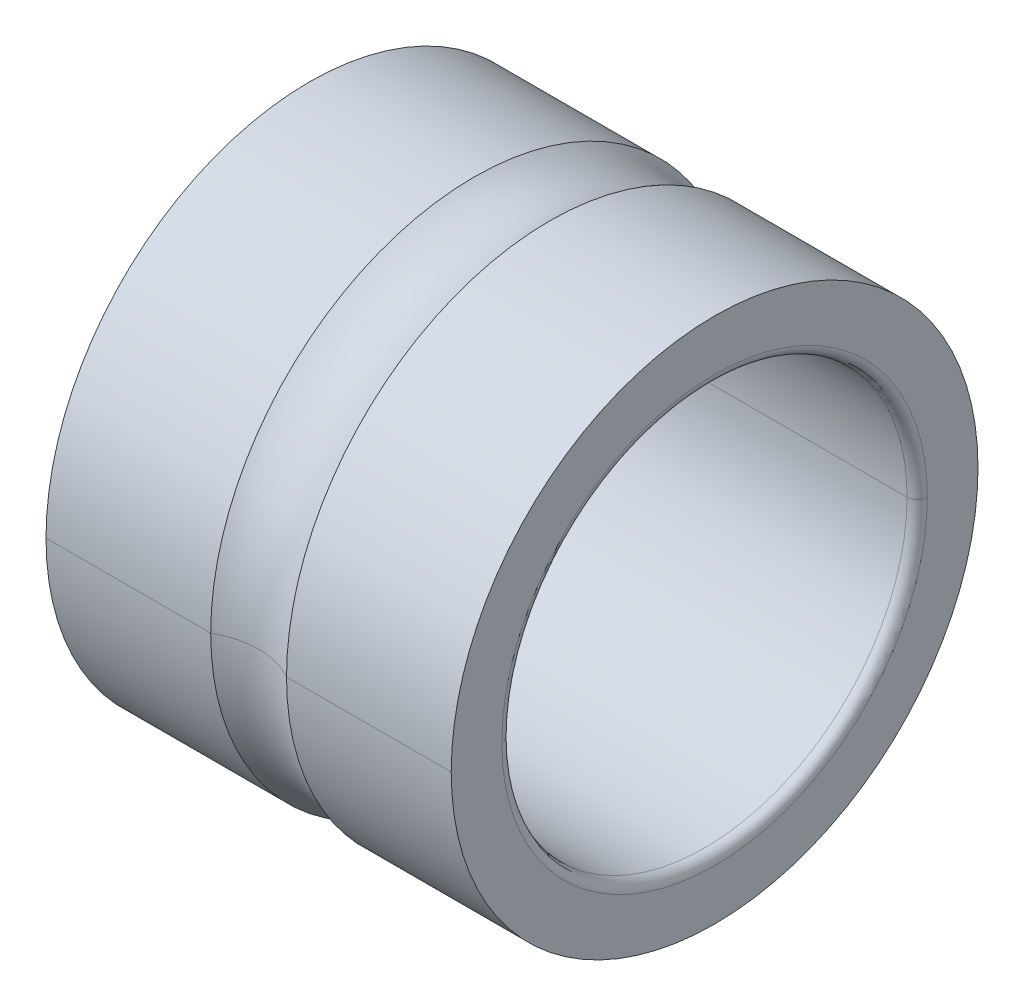
ISO-10303-21;
HEADER;
FILE_DESCRIPTION(('STEP AP214'),'2;1');
FILE_NAME('part.step','',(''),(''),'','','');
FILE_SCHEMA(('AUTOMOTIVE_DESIGN { 1 0 10303 214 1 1 1 1 }'));
ENDSEC;
DATA;
#1=APPLICATION_CONTEXT('core data for automotive mechanical design processes');
#2=APPLICATION_PROTOCOL_DEFINITION('international standard','automotive_design',2000,#1);
#3=PRODUCT_CONTEXT('',#1,'mechanical');
#4=PRODUCT('Part','Part','',(#3));
#5=PRODUCT_RELATED_PRODUCT_CATEGORY('part','',(#4));
#6=PRODUCT_DEFINITION_FORMATION('','',#4);
#7=PRODUCT_DEFINITION_CONTEXT('part definition',#1,'design');
#8=PRODUCT_DEFINITION('design','',#6,#7);
#9=PRODUCT_DEFINITION_SHAPE('','',#8);
#10=(LENGTH_UNIT() NAMED_UNIT(*) SI_UNIT(.MILLI.,.METRE.));
#11=(NAMED_UNIT(*) PLANE_ANGLE_UNIT() SI_UNIT($,.RADIAN.));
#12=(NAMED_UNIT(*) SI_UNIT($,.STERADIAN.) SOLID_ANGLE_UNIT());
#13=UNCERTAINTY_MEASURE_WITH_UNIT(LENGTH_MEASURE(1.E-05),#10,'distance_accuracy_value','');
#14=(GEOMETRIC_REPRESENTATION_CONTEXT(3) GLOBAL_UNCERTAINTY_ASSIGNED_CONTEXT((#13)) GLOBAL_UNIT_ASSIGNED_CONTEXT((#10,
#11,#12)) REPRESENTATION_CONTEXT('',''));
#15=CARTESIAN_POINT('',(0.,0.,0.));
#16=DIRECTION('',(0.,0.,1.));
#17=DIRECTION('',(1.,0.,0.));
#18=AXIS2_PLACEMENT_3D('',#15,#16,#17);
#19=CARTESIAN_POINT('',(0.,2.6,0.));
#20=DIRECTION('',(-1.,0.,0.));
#21=DIRECTION('',(0.,0.,1.));
#22=AXIS2_PLACEMENT_3D('',#19,#20,#21);
#23=PLANE('',#22);
#24=CARTESIAN_POINT('',(0.,0.,0.));
#25=DIRECTION('',(1.,0.,0.));
#26=DIRECTION('',(0.,0.,-1.));
#27=AXIS2_PLACEMENT_3D('',#24,#25,#26);
#28=CIRCLE('',#27,2.1);
#29=CARTESIAN_POINT('',(0.,0.,-2.1));
#30=VERTEX_POINT('',#29);
#31=CARTESIAN_POINT('',(0.,0.,2.1));
#32=VERTEX_POINT('',#31);
#33=EDGE_CURVE('E11',#30,#32,#28,.T.);
#34=ORIENTED_EDGE('',*,*,#33,.T.);
#35=CARTESIAN_POINT('',(0.,0.,0.));
#36=DIRECTION('',(1.,0.,0.));
#37=DIRECTION('',(0.,0.,-1.));
#38=AXIS2_PLACEMENT_3D('',#35,#36,#37);
#39=CIRCLE('',#38,2.1);
#40=EDGE_CURVE('E25',#32,#30,#39,.T.);
#41=ORIENTED_EDGE('',*,*,#40,.T.);
#42=EDGE_LOOP('',(#34,#41));
#43=FACE_BOUND('',#42,.T.);
#44=CARTESIAN_POINT('',(0.,0.,0.));
#45=DIRECTION('',(1.,0.,0.));
#46=DIRECTION('',(0.,0.,-1.));
#47=AXIS2_PLACEMENT_3D('',#44,#45,#46);
#48=CIRCLE('',#47,2.6);
#49=CARTESIAN_POINT('',(0.,0.,-2.6));
#50=VERTEX_POINT('',#49);
#51=CARTESIAN_POINT('',(0.,0.,2.6));
#52=VERTEX_POINT('',#51);
#53=EDGE_CURVE('E323',#50,#52,#48,.T.);
#54=ORIENTED_EDGE('',*,*,#53,.F.);
#55=CARTESIAN_POINT('',(0.,0.,0.));
#56=DIRECTION('',(1.,0.,0.));
#57=DIRECTION('',(0.,0.,-1.));
#58=AXIS2_PLACEMENT_3D('',#55,#56,#57);
#59=CIRCLE('',#58,2.6);
#60=EDGE_CURVE('E318',#52,#50,#59,.T.);
#61=ORIENTED_EDGE('',*,*,#60,.F.);
#62=EDGE_LOOP('',(#54,#61));
#63=FACE_BOUND('',#62,.T.);
#64=ADVANCED_FACE('F17',(#43,#63),#23,.T.);
#65=CARTESIAN_POINT('',(4.,0.,0.));
#66=DIRECTION('',(-1.,0.,0.));
#67=DIRECTION('',(0.,1.,0.));
#68=AXIS2_PLACEMENT_3D('',#65,#66,#67);
#69=CYLINDRICAL_SURFACE('',#68,2.6);
#70=ORIENTED_EDGE('',*,*,#60,.T.);
#71=DIRECTION('',(-1.,0.,0.));
#72=VECTOR('',#71,1.);
#73=CARTESIAN_POINT('',(1.6258342613226,0.,-2.6));
#74=LINE('',#73,#72);
#75=CARTESIAN_POINT('',(1.6258342613226,0.,-2.6));
#76=VERTEX_POINT('',#75);
#77=EDGE_CURVE('E313',#76,#50,#74,.T.);
#78=ORIENTED_EDGE('',*,*,#77,.F.);
#79=CARTESIAN_POINT('',(1.6258342613226,0.,0.));
#80=DIRECTION('',(1.,0.,0.));
#81=DIRECTION('',(0.,0.,-1.));
#82=AXIS2_PLACEMENT_3D('',#79,#80,#81);
#83=CIRCLE('',#82,2.6);
#84=CARTESIAN_POINT('',(1.6258342613226,0.,2.6));
#85=VERTEX_POINT('',#84);
#86=EDGE_CURVE('E309',#85,#76,#83,.T.);
#87=ORIENTED_EDGE('',*,*,#86,.F.);
#88=DIRECTION('',(-1.,0.,0.));
#89=VECTOR('',#88,1.);
#90=CARTESIAN_POINT('',(1.6258342613226,0.,2.6));
#91=LINE('',#90,#89);
#92=EDGE_CURVE('E304',#85,#52,#91,.T.);
#93=ORIENTED_EDGE('',*,*,#92,.T.);
#94=EDGE_LOOP('',(#70,#78,#87,#93));
#95=FACE_BOUND('',#94,.T.);
#96=ADVANCED_FACE('F338',(#95),#69,.T.);
#97=CARTESIAN_POINT('',(4.,0.,0.));
#98=DIRECTION('',(-1.,0.,0.));
#99=DIRECTION('',(0.,-1.,0.));
#100=AXIS2_PLACEMENT_3D('',#97,#98,#99);
#101=CYLINDRICAL_SURFACE('',#100,2.6);
#102=CARTESIAN_POINT('',(1.6258342613226,0.,0.));
#103=DIRECTION('',(1.,0.,0.));
#104=DIRECTION('',(0.,0.,-1.));
#105=AXIS2_PLACEMENT_3D('',#102,#103,#104);
#106=CIRCLE('',#105,2.6);
#107=EDGE_CURVE('E302',#76,#85,#106,.T.);
#108=ORIENTED_EDGE('',*,*,#107,.F.);
#109=ORIENTED_EDGE('',*,*,#77,.T.);
#110=ORIENTED_EDGE('',*,*,#53,.T.);
#111=ORIENTED_EDGE('',*,*,#92,.F.);
#112=EDGE_LOOP('',(#108,#109,#110,#111));
#113=FACE_BOUND('',#112,.T.);
#114=ADVANCED_FACE('F335',(#113),#101,.T.);
#115=CARTESIAN_POINT('',(2.,0.,0.));
#116=DIRECTION('',(1.,0.,0.));
#117=DIRECTION('',(0.,-1.,0.));
#118=AXIS2_PLACEMENT_3D('',#115,#116,#117);
#119=TOROIDAL_SURFACE('',#118,3.25,0.75);
#120=ORIENTED_EDGE('',*,*,#107,.T.);
#121=CARTESIAN_POINT('',(2.3741657386774,0.,2.6));
#122=CARTESIAN_POINT('',(2.36709274948748,0.,2.59592844855521));
#123=CARTESIAN_POINT('',(2.35995325635981,0.,2.5919724333997));
#124=CARTESIAN_POINT('',(2.34554897522928,0.,2.58429549354971));
#125=CARTESIAN_POINT('',(2.33828418722642,0.,2.58057456885522));
#126=CARTESIAN_POINT('',(2.32363702934586,0.,2.57337182780966));
#127=CARTESIAN_POINT('',(2.31625465946816,0.,2.5698900114586));
#128=CARTESIAN_POINT('',(2.30138021190552,0.,2.56316918306985));
#129=CARTESIAN_POINT('',(2.29388813422059,0.,2.55993017103215));
#130=CARTESIAN_POINT('',(2.27880225242789,0.,2.55369840649824));
#131=CARTESIAN_POINT('',(2.27120844832012,0.,2.55070565400202));
#132=CARTESIAN_POINT('',(2.25592720603228,0.,2.5449695965506));
#133=CARTESIAN_POINT('',(2.24823976785221,0.,2.54222629159541));
#134=CARTESIAN_POINT('',(2.2327794488567,0.,2.53699205271054));
#135=CARTESIAN_POINT('',(2.22500656804126,0.,2.53450111878086));
#136=CARTESIAN_POINT('',(2.20938364644233,0.,2.52977427616394));
#137=CARTESIAN_POINT('',(2.20153360565885,0.,2.52753836747669));
#138=CARTESIAN_POINT('',(2.1857647289619,0.,2.52332395790437));
#139=CARTESIAN_POINT('',(2.17784589304843,0.,2.52134545701929));
#140=CARTESIAN_POINT('',(2.16194786424952,0.,2.51764797129756));
#141=CARTESIAN_POINT('',(2.15396867136409,0.,2.5159289864609));
#142=CARTESIAN_POINT('',(2.13795843109094,0.,2.51275236455371));
#143=CARTESIAN_POINT('',(2.12992738370323,0.,2.51129472748317));
#144=CARTESIAN_POINT('',(2.11382199215127,0.,2.50864235433715));
#145=CARTESIAN_POINT('',(2.10574764798703,0.,2.50744761826166));
#146=CARTESIAN_POINT('',(2.08956426674372,0.,2.50532232019299));
#147=CARTESIAN_POINT('',(2.08145522966466,0.,2.50439175819981));
#148=CARTESIAN_POINT('',(2.06521110342155,0.,2.50279579988424));
#149=CARTESIAN_POINT('',(2.05707601425751,0.,2.50213040356185));
#150=CARTESIAN_POINT('',(2.04078845243487,0.,2.50106548562104));
#151=CARTESIAN_POINT('',(2.03263597977627,0.,2.50066596400261));
#152=CARTESIAN_POINT('',(2.01632233807845,0.,2.5001332211921));
#153=CARTESIAN_POINT('',(2.00816116903922,0.,2.5));
#154=CARTESIAN_POINT('',(1.99183883096078,0.,2.5));
#155=CARTESIAN_POINT('',(1.98367766192156,0.,2.5001332211921));
#156=CARTESIAN_POINT('',(1.96736402022374,0.,2.50066596400262));
#157=CARTESIAN_POINT('',(1.95921154756514,0.,2.50106548562104));
#158=CARTESIAN_POINT('',(1.9429239857425,0.,2.50213040356185));
#159=CARTESIAN_POINT('',(1.93478889657845,0.,2.50279579988424));
#160=CARTESIAN_POINT('',(1.91854477033534,0.,2.50439175819981));
#161=CARTESIAN_POINT('',(1.91043573325628,0.,2.50532232019299));
#162=CARTESIAN_POINT('',(1.89425235201297,0.,2.50744761826166));
#163=CARTESIAN_POINT('',(1.88617800784873,0.,2.50864235433715));
#164=CARTESIAN_POINT('',(1.87007261629678,0.,2.51129472748317));
#165=CARTESIAN_POINT('',(1.86204156890906,0.,2.51275236455371));
#166=CARTESIAN_POINT('',(1.84603132863591,0.,2.5159289864609));
#167=CARTESIAN_POINT('',(1.83805213575048,0.,2.51764797129756));
#168=CARTESIAN_POINT('',(1.82215410695158,0.,2.52134545701929));
#169=CARTESIAN_POINT('',(1.8142352710381,0.,2.52332395790437));
#170=CARTESIAN_POINT('',(1.79846639434115,0.,2.52753836747669));
#171=CARTESIAN_POINT('',(1.79061635355767,0.,2.52977427616394));
#172=CARTESIAN_POINT('',(1.77499343195874,0.,2.53450111878086));
#173=CARTESIAN_POINT('',(1.7672205511433,0.,2.53699205271054));
#174=CARTESIAN_POINT('',(1.75176023214779,0.,2.5422262915954));
#175=CARTESIAN_POINT('',(1.74407279396772,0.,2.5449695965506));
#176=CARTESIAN_POINT('',(1.72879155167988,0.,2.55070565400201));
#177=CARTESIAN_POINT('',(1.72119774757211,0.,2.55369840649824));
#178=CARTESIAN_POINT('',(1.70611186577941,0.,2.55993017103215));
#179=CARTESIAN_POINT('',(1.69861978809448,0.,2.56316918306984));
#180=CARTESIAN_POINT('',(1.68374534053185,0.,2.5698900114586));
#181=CARTESIAN_POINT('',(1.67636297065414,0.,2.57337182780966));
#182=CARTESIAN_POINT('',(1.66171581277358,0.,2.58057456885521));
#183=CARTESIAN_POINT('',(1.65445102477072,0.,2.58429549354971));
#184=CARTESIAN_POINT('',(1.64004674364019,0.,2.5919724333997));
#185=CARTESIAN_POINT('',(1.63290725051252,0.,2.5959284485552));
#186=CARTESIAN_POINT('',(1.6258342613226,0.,2.6));
#187=B_SPLINE_CURVE_WITH_KNOTS('',3,(#121,#122,#123,#124,#125,#126,#127,#128,#129,#130,#131,
#132,#133,#134,#135,#136,#137,#138,#139,#140,#141,#142,#143,#144,#145,#146,#147,#148,#149,#150,
#151,#152,#153,#154,#155,#156,#157,#158,#159,#160,#161,#162,#163,#164,#165,#166,#167,#168,#169,
#170,#171,#172,#173,#174,#175,#176,#177,#178,#179,#180,#181,#182,#183,#184,#185,#186),
.UNSPECIFIED.,.F.,.F.,(4,2,2,2,2,2,2,2,2,2,2,2,2,2,2,2,2,2,2,2,2,2,2,2,2,2,2,2,2,2,2,2,4),(0.,
0.0244824201425143,0.048964840285028,0.0734472604275421,0.0979296805700558,0.12241210071257,
0.146894520855084,0.171376940997598,0.195859361140112,0.220341781282626,0.244824201425139,
0.269306621567654,0.293789041710168,0.318271461852682,0.342753881995195,0.36723630213771,
0.391718722280224,0.416201142422738,0.440683562565252,0.465165982707765,0.489648402850279,
0.514130822992793,0.538613243135307,0.563095663277821,0.587578083420335,0.612060503562849,
0.636542923705363,0.661025343847877,0.685507763990391,0.709990184132905,0.734472604275419,
0.758955024417933,0.783437444560447),.UNSPECIFIED.);
#188=CARTESIAN_POINT('',(2.3741657386774,0.,2.6));
#189=VERTEX_POINT('',#188);
#190=EDGE_CURVE('E270',#189,#85,#187,.T.);
#191=ORIENTED_EDGE('',*,*,#190,.F.);
#192=CARTESIAN_POINT('',(2.3741657386774,0.,0.));
#193=DIRECTION('',(1.,0.,0.));
#194=DIRECTION('',(0.,0.,-1.));
#195=AXIS2_PLACEMENT_3D('',#192,#193,#194);
#196=CIRCLE('',#195,2.6);
#197=CARTESIAN_POINT('',(2.3741657386774,0.,-2.6));
#198=VERTEX_POINT('',#197);
#199=EDGE_CURVE('E288',#198,#189,#196,.T.);
#200=ORIENTED_EDGE('',*,*,#199,.F.);
#201=CARTESIAN_POINT('',(2.3741657386774,0.,-2.6));
#202=CARTESIAN_POINT('',(2.36709274948748,0.,-2.5959284485552));
#203=CARTESIAN_POINT('',(2.35995325635981,0.,-2.5919724333997));
#204=CARTESIAN_POINT('',(2.34554897522928,0.,-2.58429549354971));
#205=CARTESIAN_POINT('',(2.33828418722642,0.,-2.58057456885521));
#206=CARTESIAN_POINT('',(2.32363702934586,0.,-2.57337182780966));
#207=CARTESIAN_POINT('',(2.31625465946816,0.,-2.5698900114586));
#208=CARTESIAN_POINT('',(2.30138021190552,0.,-2.56316918306985));
#209=CARTESIAN_POINT('',(2.29388813422059,0.,-2.55993017103215));
#210=CARTESIAN_POINT('',(2.27880225242789,0.,-2.55369840649824));
#211=CARTESIAN_POINT('',(2.27120844832012,0.,-2.55070565400201));
#212=CARTESIAN_POINT('',(2.25592720603228,0.,-2.5449695965506));
#213=CARTESIAN_POINT('',(2.24823976785221,0.,-2.54222629159541));
#214=CARTESIAN_POINT('',(2.2327794488567,0.,-2.53699205271054));
#215=CARTESIAN_POINT('',(2.22500656804126,0.,-2.53450111878086));
#216=CARTESIAN_POINT('',(2.20938364644233,0.,-2.52977427616394));
#217=CARTESIAN_POINT('',(2.20153360565885,0.,-2.52753836747669));
#218=CARTESIAN_POINT('',(2.1857647289619,0.,-2.52332395790437));
#219=CARTESIAN_POINT('',(2.17784589304843,0.,-2.52134545701929));
#220=CARTESIAN_POINT('',(2.16194786424952,0.,-2.51764797129756));
#221=CARTESIAN_POINT('',(2.15396867136409,0.,-2.5159289864609));
#222=CARTESIAN_POINT('',(2.13795843109094,0.,-2.51275236455371));
#223=CARTESIAN_POINT('',(2.12992738370323,0.,-2.51129472748317));
#224=CARTESIAN_POINT('',(2.11382199215127,0.,-2.50864235433715));
#225=CARTESIAN_POINT('',(2.10574764798703,0.,-2.50744761826166));
#226=CARTESIAN_POINT('',(2.08956426674372,0.,-2.50532232019299));
#227=CARTESIAN_POINT('',(2.08145522966466,0.,-2.50439175819981));
#228=CARTESIAN_POINT('',(2.06521110342155,0.,-2.50279579988424));
#229=CARTESIAN_POINT('',(2.05707601425751,0.,-2.50213040356185));
#230=CARTESIAN_POINT('',(2.04078845243487,0.,-2.50106548562104));
#231=CARTESIAN_POINT('',(2.03263597977627,0.,-2.50066596400262));
#232=CARTESIAN_POINT('',(2.01632233807844,0.,-2.5001332211921));
#233=CARTESIAN_POINT('',(2.00816116903922,0.,-2.5));
#234=CARTESIAN_POINT('',(1.99183883096078,0.,-2.5));
#235=CARTESIAN_POINT('',(1.98367766192156,0.,-2.5001332211921));
#236=CARTESIAN_POINT('',(1.96736402022373,0.,-2.50066596400262));
#237=CARTESIAN_POINT('',(1.95921154756514,0.,-2.50106548562104));
#238=CARTESIAN_POINT('',(1.94292398574249,0.,-2.50213040356185));
#239=CARTESIAN_POINT('',(1.93478889657845,0.,-2.50279579988424));
#240=CARTESIAN_POINT('',(1.91854477033534,0.,-2.50439175819981));
#241=CARTESIAN_POINT('',(1.91043573325628,0.,-2.50532232019299));
#242=CARTESIAN_POINT('',(1.89425235201297,0.,-2.50744761826166));
#243=CARTESIAN_POINT('',(1.88617800784873,0.,-2.50864235433715));
#244=CARTESIAN_POINT('',(1.87007261629677,0.,-2.51129472748317));
#245=CARTESIAN_POINT('',(1.86204156890906,0.,-2.51275236455371));
#246=CARTESIAN_POINT('',(1.84603132863591,0.,-2.5159289864609));
#247=CARTESIAN_POINT('',(1.83805213575048,0.,-2.51764797129756));
#248=CARTESIAN_POINT('',(1.82215410695157,0.,-2.52134545701929));
#249=CARTESIAN_POINT('',(1.8142352710381,0.,-2.52332395790437));
#250=CARTESIAN_POINT('',(1.79846639434115,0.,-2.52753836747669));
#251=CARTESIAN_POINT('',(1.79061635355767,0.,-2.52977427616394));
#252=CARTESIAN_POINT('',(1.77499343195874,0.,-2.53450111878086));
#253=CARTESIAN_POINT('',(1.7672205511433,0.,-2.53699205271054));
#254=CARTESIAN_POINT('',(1.75176023214779,0.,-2.5422262915954));
#255=CARTESIAN_POINT('',(1.74407279396772,0.,-2.5449695965506));
#256=CARTESIAN_POINT('',(1.72879155167988,0.,-2.55070565400201));
#257=CARTESIAN_POINT('',(1.72119774757211,0.,-2.55369840649824));
#258=CARTESIAN_POINT('',(1.70611186577941,0.,-2.55993017103215));
#259=CARTESIAN_POINT('',(1.69861978809448,0.,-2.56316918306984));
#260=CARTESIAN_POINT('',(1.68374534053184,0.,-2.5698900114586));
#261=CARTESIAN_POINT('',(1.67636297065414,0.,-2.57337182780966));
#262=CARTESIAN_POINT('',(1.66171581277358,0.,-2.58057456885521));
#263=CARTESIAN_POINT('',(1.65445102477072,0.,-2.58429549354971));
#264=CARTESIAN_POINT('',(1.64004674364019,0.,-2.5919724333997));
#265=CARTESIAN_POINT('',(1.63290725051252,0.,-2.5959284485552));
#266=CARTESIAN_POINT('',(1.6258342613226,0.,-2.6));
#267=B_SPLINE_CURVE_WITH_KNOTS('',3,(#201,#202,#203,#204,#205,#206,#207,#208,#209,#210,#211,
#212,#213,#214,#215,#216,#217,#218,#219,#220,#221,#222,#223,#224,#225,#226,#227,#228,#229,#230,
#231,#232,#233,#234,#235,#236,#237,#238,#239,#240,#241,#242,#243,#244,#245,#246,#247,#248,#249,
#250,#251,#252,#253,#254,#255,#256,#257,#258,#259,#260,#261,#262,#263,#264,#265,#266),
.UNSPECIFIED.,.F.,.F.,(4,2,2,2,2,2,2,2,2,2,2,2,2,2,2,2,2,2,2,2,2,2,2,2,2,2,2,2,2,2,2,2,4),(0.,
0.0244824201425139,0.048964840285028,0.0734472604275415,0.0979296805700558,0.12241210071257,
0.146894520855084,0.171376940997598,0.195859361140111,0.220341781282625,0.244824201425139,
0.269306621567653,0.293789041710167,0.318271461852682,0.342753881995195,0.367236302137709,
0.391718722280223,0.416201142422737,0.440683562565251,0.465165982707765,0.489648402850279,
0.514130822992793,0.538613243135307,0.563095663277821,0.587578083420335,0.612060503562849,
0.636542923705363,0.661025343847877,0.68550776399039,0.709990184132905,0.734472604275419,
0.758955024417933,0.783437444560447),.UNSPECIFIED.);
#268=EDGE_CURVE('E273',#198,#76,#267,.T.);
#269=ORIENTED_EDGE('',*,*,#268,.T.);
#270=EDGE_LOOP('',(#120,#191,#200,#269));
#271=FACE_BOUND('',#270,.T.);
#272=ADVANCED_FACE('F252',(#271),#119,.F.);
#273=CARTESIAN_POINT('',(2.,0.,0.));
#274=DIRECTION('',(1.,0.,0.));
#275=DIRECTION('',(0.,1.,0.));
#276=AXIS2_PLACEMENT_3D('',#273,#274,#275);
#277=TOROIDAL_SURFACE('',#276,3.25,0.75);
#278=CARTESIAN_POINT('',(2.3741657386774,0.,0.));
#279=DIRECTION('',(1.,0.,0.));
#280=DIRECTION('',(0.,0.,-1.));
#281=AXIS2_PLACEMENT_3D('',#278,#279,#280);
#282=CIRCLE('',#281,2.6);
#283=EDGE_CURVE('E232',#189,#198,#282,.T.);
#284=ORIENTED_EDGE('',*,*,#283,.F.);
#285=ORIENTED_EDGE('',*,*,#190,.T.);
#286=ORIENTED_EDGE('',*,*,#86,.T.);
#287=ORIENTED_EDGE('',*,*,#268,.F.);
#288=EDGE_LOOP('',(#284,#285,#286,#287));
#289=FACE_BOUND('',#288,.T.);
#290=ADVANCED_FACE('F241',(#289),#277,.F.);
#291=CARTESIAN_POINT('',(4.,0.,0.));
#292=DIRECTION('',(-1.,0.,0.));
#293=DIRECTION('',(0.,1.,0.));
#294=AXIS2_PLACEMENT_3D('',#291,#292,#293);
#295=CYLINDRICAL_SURFACE('',#294,2.6);
#296=ORIENTED_EDGE('',*,*,#283,.T.);
#297=DIRECTION('',(-1.,0.,0.));
#298=VECTOR('',#297,1.);
#299=CARTESIAN_POINT('',(4.,0.,-2.6));
#300=LINE('',#299,#298);
#301=CARTESIAN_POINT('',(4.,0.,-2.6));
#302=VERTEX_POINT('',#301);
#303=EDGE_CURVE('E227',#302,#198,#300,.T.);
#304=ORIENTED_EDGE('',*,*,#303,.F.);
#305=CARTESIAN_POINT('',(4.,0.,0.));
#306=DIRECTION('',(1.,0.,0.));
#307=DIRECTION('',(0.,0.,-1.));
#308=AXIS2_PLACEMENT_3D('',#305,#306,#307);
#309=CIRCLE('',#308,2.6);
#310=CARTESIAN_POINT('',(4.,0.,2.6));
#311=VERTEX_POINT('',#310);
#312=EDGE_CURVE('E222',#311,#302,#309,.T.);
#313=ORIENTED_EDGE('',*,*,#312,.F.);
#314=DIRECTION('',(-1.,0.,0.));
#315=VECTOR('',#314,1.);
#316=CARTESIAN_POINT('',(4.,0.,2.6));
#317=LINE('',#316,#315);
#318=EDGE_CURVE('E217',#311,#189,#317,.T.);
#319=ORIENTED_EDGE('',*,*,#318,.T.);
#320=EDGE_LOOP('',(#296,#304,#313,#319));
#321=FACE_BOUND('',#320,.T.);
#322=ADVANCED_FACE('F251',(#321),#295,.T.);
#323=CARTESIAN_POINT('',(4.,0.,0.));
#324=DIRECTION('',(-1.,0.,0.));
#325=DIRECTION('',(0.,-1.,0.));
#326=AXIS2_PLACEMENT_3D('',#323,#324,#325);
#327=CYLINDRICAL_SURFACE('',#326,2.6);
#328=CARTESIAN_POINT('',(4.,0.,0.));
#329=DIRECTION('',(1.,0.,0.));
#330=DIRECTION('',(0.,0.,-1.));
#331=AXIS2_PLACEMENT_3D('',#328,#329,#330);
#332=CIRCLE('',#331,2.6);
#333=EDGE_CURVE('E212',#302,#311,#332,.T.);
#334=ORIENTED_EDGE('',*,*,#333,.F.);
#335=ORIENTED_EDGE('',*,*,#303,.T.);
#336=ORIENTED_EDGE('',*,*,#199,.T.);
#337=ORIENTED_EDGE('',*,*,#318,.F.);
#338=EDGE_LOOP('',(#334,#335,#336,#337));
#339=FACE_BOUND('',#338,.T.);
#340=ADVANCED_FACE('F343',(#339),#327,.T.);
#341=CARTESIAN_POINT('',(4.,2.1,0.));
#342=DIRECTION('',(1.,0.,0.));
#343=DIRECTION('',(0.,0.,-1.));
#344=AXIS2_PLACEMENT_3D('',#341,#342,#343);
#345=PLANE('',#344);
#346=ORIENTED_EDGE('',*,*,#333,.T.);
#347=ORIENTED_EDGE('',*,*,#312,.T.);
#348=EDGE_LOOP('',(#346,#347));
#349=FACE_BOUND('',#348,.T.);
#350=CARTESIAN_POINT('',(4.,0.,0.));
#351=DIRECTION('',(1.,0.,0.));
#352=DIRECTION('',(0.,0.,-1.));
#353=AXIS2_PLACEMENT_3D('',#350,#351,#352);
#354=CIRCLE('',#353,2.1);
#355=CARTESIAN_POINT('',(4.,0.,-2.1));
#356=VERTEX_POINT('',#355);
#357=CARTESIAN_POINT('',(4.00000000000015,0.,2.1));
#358=VERTEX_POINT('',#357);
#359=EDGE_CURVE('E208',#356,#358,#354,.T.);
#360=ORIENTED_EDGE('',*,*,#359,.F.);
#361=CARTESIAN_POINT('',(4.,0.,0.));
#362=DIRECTION('',(1.,0.,0.));
#363=DIRECTION('',(0.,0.,-1.));
#364=AXIS2_PLACEMENT_3D('',#361,#362,#363);
#365=CIRCLE('',#364,2.1);
#366=EDGE_CURVE('E206',#358,#356,#365,.T.);
#367=ORIENTED_EDGE('',*,*,#366,.F.);
#368=EDGE_LOOP('',(#360,#367));
#369=FACE_BOUND('',#368,.T.);
#370=ADVANCED_FACE('F345',(#349,#369),#345,.T.);
#371=CARTESIAN_POINT('',(3.90000000000015,0.,0.));
#372=DIRECTION('',(1.,0.,0.));
#373=DIRECTION('',(0.,1.,0.));
#374=AXIS2_PLACEMENT_3D('',#371,#372,#373);
#375=TOROIDAL_SURFACE('',#374,2.1,0.1);
#376=ORIENTED_EDGE('',*,*,#366,.T.);
#377=CARTESIAN_POINT('',(4.00000000000015,0.,-2.1));
#378=CARTESIAN_POINT('',(4.00000003470903,0.,-2.09836375217391));
#379=CARTESIAN_POINT('',(3.99995984171267,0.,-2.0967275073012));
#380=CARTESIAN_POINT('',(3.99979924952867,0.,-2.0934589578333));
#381=CARTESIAN_POINT('',(3.99967885034103,0.,-2.09182665323811));
#382=CARTESIAN_POINT('',(3.9993580949937,0.,-2.08856991869596));
#383=CARTESIAN_POINT('',(3.999157738834,0.,-2.08694548874901));
#384=CARTESIAN_POINT('',(3.99867756315925,0.,-2.08370841635989));
#385=CARTESIAN_POINT('',(3.99839774364419,0.,-2.08209577391771));
#386=CARTESIAN_POINT('',(3.99775931243675,0.,-2.07888616167903));
#387=CARTESIAN_POINT('',(3.99740070074437,0.,-2.07728919188254));
#388=CARTESIAN_POINT('',(3.99660554989482,0.,-2.07411477213676));
#389=CARTESIAN_POINT('',(3.99616901073765,0.,-2.07253732218748));
#390=CARTESIAN_POINT('',(3.99521905640908,0.,-2.06940574236157));
#391=CARTESIAN_POINT('',(3.99470564123768,0.,-2.06785161248494));
#392=CARTESIAN_POINT('',(3.9936031717992,0.,-2.06477041683655));
#393=CARTESIAN_POINT('',(3.9930141175321,0.,-2.0632433510648));
#394=CARTESIAN_POINT('',(3.99176178897043,0.,-2.06021996246211));
#395=CARTESIAN_POINT('',(3.99109851467584,0.,-2.05872363963118));
#396=CARTESIAN_POINT('',(3.98969934394911,0.,-2.05576534168269));
#397=CARTESIAN_POINT('',(3.98896344751696,0.,-2.05430336656514));
#398=CARTESIAN_POINT('',(3.98742080535297,0.,-2.05141728606958));
#399=CARTESIAN_POINT('',(3.98661405962113,0.,-2.04999318069158));
#400=CARTESIAN_POINT('',(3.98493166237917,0.,-2.04718627046969));
#401=CARTESIAN_POINT('',(3.98405601086906,0.,-2.04580346562581));
#402=CARTESIAN_POINT('',(3.98223791159168,0.,-2.04308248777017));
#403=CARTESIAN_POINT('',(3.98129546382441,0.,-2.04174431475841));
#404=CARTESIAN_POINT('',(3.97934604247195,0.,-2.039115824343));
#405=CARTESIAN_POINT('',(3.97833906888675,0.,-2.03782550693936));
#406=CARTESIAN_POINT('',(3.97626302178601,0.,-2.03529583622781));
#407=CARTESIAN_POINT('',(3.97519394827046,0.,-2.03405648291992));
#408=CARTESIAN_POINT('',(3.97299627680074,0.,-2.03163172611057));
#409=CARTESIAN_POINT('',(3.97186767884657,0.,-2.03044632260911));
#410=CARTESIAN_POINT('',(3.96955367739093,0.,-2.02813232115348));
#411=CARTESIAN_POINT('',(3.96836827388947,0.,-2.02700372319931));
#412=CARTESIAN_POINT('',(3.96594351708011,0.,-2.02480605172959));
#413=CARTESIAN_POINT('',(3.96470416377222,0.,-2.02373697821404));
#414=CARTESIAN_POINT('',(3.96217449306068,0.,-2.0216609311133));
#415=CARTESIAN_POINT('',(3.96088417565703,0.,-2.02065395752811));
#416=CARTESIAN_POINT('',(3.95825568524162,0.,-2.01870453617565));
#417=CARTESIAN_POINT('',(3.95691751222985,0.,-2.01776208840838));
#418=CARTESIAN_POINT('',(3.95419653437421,0.,-2.01594398913101));
#419=CARTESIAN_POINT('',(3.95281372953033,0.,-2.0150683376209));
#420=CARTESIAN_POINT('',(3.95000681930844,0.,-2.01338594037895));
#421=CARTESIAN_POINT('',(3.94858271393044,0.,-2.01257919464711));
#422=CARTESIAN_POINT('',(3.94569663343488,0.,-2.01103655248312));
#423=CARTESIAN_POINT('',(3.94423465831733,0.,-2.01030065605097));
#424=CARTESIAN_POINT('',(3.94127636036884,0.,-2.00890148532425));
#425=CARTESIAN_POINT('',(3.9397800375379,0.,-2.00823821102966));
#426=CARTESIAN_POINT('',(3.93675664893521,0.,-2.00698588246799));
#427=CARTESIAN_POINT('',(3.93522958316346,0.,-2.0063968282009));
#428=CARTESIAN_POINT('',(3.93214838751507,0.,-2.00529435876242));
#429=CARTESIAN_POINT('',(3.93059425763844,0.,-2.00478094359103));
#430=CARTESIAN_POINT('',(3.92746267781252,0.,-2.00383098926246));
#431=CARTESIAN_POINT('',(3.92588522786324,0.,-2.00339445010529));
#432=CARTESIAN_POINT('',(3.92271080811747,0.,-2.00259929925574));
#433=CARTESIAN_POINT('',(3.92111383832097,0.,-2.00224068756337));
#434=CARTESIAN_POINT('',(3.9179042260823,0.,-2.00160225635594));
#435=CARTESIAN_POINT('',(3.91629158364012,0.,-2.00132243684088));
#436=CARTESIAN_POINT('',(3.91305451125099,0.,-2.00084226116613));
#437=CARTESIAN_POINT('',(3.91143008130404,0.,-2.00064190500643));
#438=CARTESIAN_POINT('',(3.90817334676189,0.,-2.0003211496591));
#439=CARTESIAN_POINT('',(3.9065410421667,0.,-2.00020075047147));
#440=CARTESIAN_POINT('',(3.9032724926988,0.,-2.00004015828748));
#441=CARTESIAN_POINT('',(3.90163624782609,0.,-1.99999996529112));
#442=CARTESIAN_POINT('',(3.9,0.,-2.));
#443=B_SPLINE_CURVE_WITH_KNOTS('',3,(#377,#378,#379,#380,#381,#382,#383,#384,#385,#386,#387,
#388,#389,#390,#391,#392,#393,#394,#395,#396,#397,#398,#399,#400,#401,#402,#403,#404,#405,#406,
#407,#408,#409,#410,#411,#412,#413,#414,#415,#416,#417,#418,#419,#420,#421,#422,#423,#424,#425,
#426,#427,#428,#429,#430,#431,#432,#433,#434,#435,#436,#437,#438,#439,#440,#441,#442),
.UNSPECIFIED.,.F.,.F.,(4,2,2,2,2,2,2,2,2,2,2,2,2,2,2,2,2,2,2,2,2,2,2,2,2,2,2,2,2,2,2,2,4),(0.,
0.00490824570458675,0.00981649140917432,0.0147247371137612,0.0196329828183485,
0.0245412285229357,0.0294494742275225,0.03435771993211,0.039265965636697,0.0441742113412843,
0.0490824570458713,0.0539907027504582,0.0588989484550458,0.0638071941596326,0.0687154398642199,
0.0736236855688071,0.0785319312733941,0.083440176977981,0.0883484226825684,0.0932566683871551,
0.0981649140917426,0.10307315979633,0.107981405500917,0.112889651205504,0.117797896910091,
0.122706142614678,0.127614388319266,0.132522634023853,0.13743087972844,0.142339125433027,
0.147247371137614,0.152155616842201,0.157063862546789),.UNSPECIFIED.);
#444=CARTESIAN_POINT('',(3.9,0.,-2.));
#445=VERTEX_POINT('',#444);
#446=EDGE_CURVE('E177',#356,#445,#443,.T.);
#447=ORIENTED_EDGE('',*,*,#446,.T.);
#448=CARTESIAN_POINT('',(3.9,0.,0.));
#449=DIRECTION('',(1.,0.,0.));
#450=DIRECTION('',(0.,0.,-1.));
#451=AXIS2_PLACEMENT_3D('',#448,#449,#450);
#452=CIRCLE('',#451,2.);
#453=CARTESIAN_POINT('',(3.9,0.,2.));
#454=VERTEX_POINT('',#453);
#455=EDGE_CURVE('E95',#454,#445,#452,.T.);
#456=ORIENTED_EDGE('',*,*,#455,.F.);
#457=CARTESIAN_POINT('',(4.00000000000015,0.,2.1));
#458=CARTESIAN_POINT('',(4.00000003470903,0.,2.09836375217391));
#459=CARTESIAN_POINT('',(3.99995984171267,0.,2.0967275073012));
#460=CARTESIAN_POINT('',(3.99979924952867,0.,2.0934589578333));
#461=CARTESIAN_POINT('',(3.99967885034103,0.,2.09182665323811));
#462=CARTESIAN_POINT('',(3.9993580949937,0.,2.08856991869596));
#463=CARTESIAN_POINT('',(3.999157738834,0.,2.08694548874901));
#464=CARTESIAN_POINT('',(3.99867756315925,0.,2.08370841635989));
#465=CARTESIAN_POINT('',(3.99839774364419,0.,2.08209577391771));
#466=CARTESIAN_POINT('',(3.99775931243675,0.,2.07888616167903));
#467=CARTESIAN_POINT('',(3.99740070074437,0.,2.07728919188254));
#468=CARTESIAN_POINT('',(3.99660554989482,0.,2.07411477213676));
#469=CARTESIAN_POINT('',(3.99616901073765,0.,2.07253732218748));
#470=CARTESIAN_POINT('',(3.99521905640908,0.,2.06940574236157));
#471=CARTESIAN_POINT('',(3.99470564123768,0.,2.06785161248494));
#472=CARTESIAN_POINT('',(3.9936031717992,0.,2.06477041683655));
#473=CARTESIAN_POINT('',(3.9930141175321,0.,2.0632433510648));
#474=CARTESIAN_POINT('',(3.99176178897043,0.,2.06021996246211));
#475=CARTESIAN_POINT('',(3.99109851467584,0.,2.05872363963118));
#476=CARTESIAN_POINT('',(3.98969934394911,0.,2.05576534168269));
#477=CARTESIAN_POINT('',(3.98896344751696,0.,2.05430336656514));
#478=CARTESIAN_POINT('',(3.98742080535297,0.,2.05141728606958));
#479=CARTESIAN_POINT('',(3.98661405962113,0.,2.04999318069158));
#480=CARTESIAN_POINT('',(3.98493166237917,0.,2.04718627046969));
#481=CARTESIAN_POINT('',(3.98405601086906,0.,2.04580346562581));
#482=CARTESIAN_POINT('',(3.98223791159168,0.,2.04308248777017));
#483=CARTESIAN_POINT('',(3.98129546382441,0.,2.04174431475841));
#484=CARTESIAN_POINT('',(3.97934604247195,0.,2.039115824343));
#485=CARTESIAN_POINT('',(3.97833906888675,0.,2.03782550693936));
#486=CARTESIAN_POINT('',(3.97626302178601,0.,2.03529583622781));
#487=CARTESIAN_POINT('',(3.97519394827046,0.,2.03405648291992));
#488=CARTESIAN_POINT('',(3.97299627680074,0.,2.03163172611057));
#489=CARTESIAN_POINT('',(3.97186767884657,0.,2.03044632260911));
#490=CARTESIAN_POINT('',(3.96955367739093,0.,2.02813232115348));
#491=CARTESIAN_POINT('',(3.96836827388947,0.,2.02700372319931));
#492=CARTESIAN_POINT('',(3.96594351708011,0.,2.02480605172959));
#493=CARTESIAN_POINT('',(3.96470416377222,0.,2.02373697821404));
#494=CARTESIAN_POINT('',(3.96217449306068,0.,2.0216609311133));
#495=CARTESIAN_POINT('',(3.96088417565703,0.,2.02065395752811));
#496=CARTESIAN_POINT('',(3.95825568524162,0.,2.01870453617565));
#497=CARTESIAN_POINT('',(3.95691751222985,0.,2.01776208840838));
#498=CARTESIAN_POINT('',(3.95419653437421,0.,2.015943989131));
#499=CARTESIAN_POINT('',(3.95281372953033,0.,2.0150683376209));
#500=CARTESIAN_POINT('',(3.95000681930844,0.,2.01338594037895));
#501=CARTESIAN_POINT('',(3.94858271393044,0.,2.01257919464711));
#502=CARTESIAN_POINT('',(3.94569663343488,0.,2.01103655248312));
#503=CARTESIAN_POINT('',(3.94423465831733,0.,2.01030065605097));
#504=CARTESIAN_POINT('',(3.94127636036884,0.,2.00890148532425));
#505=CARTESIAN_POINT('',(3.9397800375379,0.,2.00823821102966));
#506=CARTESIAN_POINT('',(3.93675664893521,0.,2.00698588246799));
#507=CARTESIAN_POINT('',(3.93522958316346,0.,2.0063968282009));
#508=CARTESIAN_POINT('',(3.93214838751507,0.,2.00529435876242));
#509=CARTESIAN_POINT('',(3.93059425763844,0.,2.00478094359103));
#510=CARTESIAN_POINT('',(3.92746267781252,0.,2.00383098926246));
#511=CARTESIAN_POINT('',(3.92588522786324,0.,2.00339445010529));
#512=CARTESIAN_POINT('',(3.92271080811747,0.,2.00259929925574));
#513=CARTESIAN_POINT('',(3.92111383832097,0.,2.00224068756337));
#514=CARTESIAN_POINT('',(3.9179042260823,0.,2.00160225635594));
#515=CARTESIAN_POINT('',(3.91629158364012,0.,2.00132243684088));
#516=CARTESIAN_POINT('',(3.91305451125099,0.,2.00084226116613));
#517=CARTESIAN_POINT('',(3.91143008130404,0.,2.00064190500643));
#518=CARTESIAN_POINT('',(3.90817334676189,0.,2.0003211496591));
#519=CARTESIAN_POINT('',(3.9065410421667,0.,2.00020075047147));
#520=CARTESIAN_POINT('',(3.9032724926988,0.,2.00004015828748));
#521=CARTESIAN_POINT('',(3.90163624782609,0.,1.99999996529112));
#522=CARTESIAN_POINT('',(3.9,0.,2.));
#523=B_SPLINE_CURVE_WITH_KNOTS('',3,(#457,#458,#459,#460,#461,#462,#463,#464,#465,#466,#467,
#468,#469,#470,#471,#472,#473,#474,#475,#476,#477,#478,#479,#480,#481,#482,#483,#484,#485,#486,
#487,#488,#489,#490,#491,#492,#493,#494,#495,#496,#497,#498,#499,#500,#501,#502,#503,#504,#505,
#506,#507,#508,#509,#510,#511,#512,#513,#514,#515,#516,#517,#518,#519,#520,#521,#522),
.UNSPECIFIED.,.F.,.F.,(4,2,2,2,2,2,2,2,2,2,2,2,2,2,2,2,2,2,2,2,2,2,2,2,2,2,2,2,2,2,2,2,4),(0.,
0.00490824570458675,0.00981649140917432,0.0147247371137612,0.0196329828183485,
0.0245412285229357,0.0294494742275225,0.03435771993211,0.039265965636697,0.0441742113412843,
0.0490824570458713,0.0539907027504582,0.0588989484550458,0.0638071941596326,0.0687154398642199,
0.0736236855688071,0.0785319312733941,0.083440176977981,0.0883484226825684,0.0932566683871561,
0.0981649140917426,0.10307315979633,0.107981405500917,0.112889651205504,0.117797896910092,
0.122706142614678,0.127614388319266,0.132522634023853,0.13743087972844,0.142339125433027,
0.147247371137614,0.152155616842201,0.157063862546789),.UNSPECIFIED.);
#524=EDGE_CURVE('E179',#358,#454,#523,.T.);
#525=ORIENTED_EDGE('',*,*,#524,.F.);
#526=EDGE_LOOP('',(#376,#447,#456,#525));
#527=FACE_BOUND('',#526,.T.);
#528=ADVANCED_FACE('F160',(#527),#375,.T.);
#529=CARTESIAN_POINT('',(3.90000000000015,0.,0.));
#530=DIRECTION('',(1.,0.,0.));
#531=DIRECTION('',(0.,-1.,0.));
#532=AXIS2_PLACEMENT_3D('',#529,#530,#531);
#533=TOROIDAL_SURFACE('',#532,2.1,0.1);
#534=CARTESIAN_POINT('',(3.9,0.,0.));
#535=DIRECTION('',(1.,0.,0.));
#536=DIRECTION('',(0.,0.,-1.));
#537=AXIS2_PLACEMENT_3D('',#534,#535,#536);
#538=CIRCLE('',#537,2.);
#539=EDGE_CURVE('E142',#445,#454,#538,.T.);
#540=ORIENTED_EDGE('',*,*,#539,.F.);
#541=ORIENTED_EDGE('',*,*,#446,.F.);
#542=ORIENTED_EDGE('',*,*,#359,.T.);
#543=ORIENTED_EDGE('',*,*,#524,.T.);
#544=EDGE_LOOP('',(#540,#541,#542,#543));
#545=FACE_BOUND('',#544,.T.);
#546=ADVANCED_FACE('F151',(#545),#533,.T.);
#547=CARTESIAN_POINT('',(4.,0.,0.));
#548=DIRECTION('',(-1.,0.,0.));
#549=DIRECTION('',(0.,-1.,0.));
#550=AXIS2_PLACEMENT_3D('',#547,#548,#549);
#551=CYLINDRICAL_SURFACE('',#550,2.);
#552=ORIENTED_EDGE('',*,*,#539,.T.);
#553=DIRECTION('',(-1.,0.,0.));
#554=VECTOR('',#553,1.);
#555=CARTESIAN_POINT('',(3.9,0.,2.));
#556=LINE('',#555,#554);
#557=CARTESIAN_POINT('',(0.0999999999999998,0.,2.));
#558=VERTEX_POINT('',#557);
#559=EDGE_CURVE('E84',#454,#558,#556,.T.);
#560=ORIENTED_EDGE('',*,*,#559,.T.);
#561=CARTESIAN_POINT('',(0.0999999999999998,0.,0.));
#562=DIRECTION('',(1.,0.,0.));
#563=DIRECTION('',(0.,0.,-1.));
#564=AXIS2_PLACEMENT_3D('',#561,#562,#563);
#565=CIRCLE('',#564,2.);
#566=CARTESIAN_POINT('',(0.0999999999999998,0.,-2.));
#567=VERTEX_POINT('',#566);
#568=EDGE_CURVE('E77',#567,#558,#565,.T.);
#569=ORIENTED_EDGE('',*,*,#568,.F.);
#570=DIRECTION('',(-1.,0.,0.));
#571=VECTOR('',#570,1.);
#572=CARTESIAN_POINT('',(3.9,0.,-2.));
#573=LINE('',#572,#571);
#574=EDGE_CURVE('E81',#445,#567,#573,.T.);
#575=ORIENTED_EDGE('',*,*,#574,.F.);
#576=EDGE_LOOP('',(#552,#560,#569,#575));
#577=FACE_BOUND('',#576,.T.);
#578=ADVANCED_FACE('F80',(#577),#551,.F.);
#579=CARTESIAN_POINT('',(4.,0.,0.));
#580=DIRECTION('',(-1.,0.,0.));
#581=DIRECTION('',(0.,1.,0.));
#582=AXIS2_PLACEMENT_3D('',#579,#580,#581);
#583=CYLINDRICAL_SURFACE('',#582,2.);
#584=CARTESIAN_POINT('',(0.0999999999999998,0.,0.));
#585=DIRECTION('',(1.,0.,0.));
#586=DIRECTION('',(0.,0.,-1.));
#587=AXIS2_PLACEMENT_3D('',#584,#585,#586);
#588=CIRCLE('',#587,2.);
#589=EDGE_CURVE('E93',#558,#567,#588,.T.);
#590=ORIENTED_EDGE('',*,*,#589,.F.);
#591=ORIENTED_EDGE('',*,*,#559,.F.);
#592=ORIENTED_EDGE('',*,*,#455,.T.);
#593=ORIENTED_EDGE('',*,*,#574,.T.);
#594=EDGE_LOOP('',(#590,#591,#592,#593));
#595=FACE_BOUND('',#594,.T.);
#596=ADVANCED_FACE('F92',(#595),#583,.F.);
#597=CARTESIAN_POINT('',(0.0999999999999228,0.,0.));
#598=DIRECTION('',(1.,0.,0.));
#599=DIRECTION('',(0.,1.,0.));
#600=AXIS2_PLACEMENT_3D('',#597,#598,#599);
#601=TOROIDAL_SURFACE('',#600,2.1,0.1);
#602=ORIENTED_EDGE('',*,*,#589,.T.);
#603=CARTESIAN_POINT('',(0.1,0.,-2.));
#604=CARTESIAN_POINT('',(0.0983637521739103,0.,-1.99999996529112));
#605=CARTESIAN_POINT('',(0.0967275073012057,0.,-2.00004015828748));
#606=CARTESIAN_POINT('',(0.0934589578333058,0.,-2.00020075047148));
#607=CARTESIAN_POINT('',(0.0918266532381104,0.,-2.00032114965911));
#608=CARTESIAN_POINT('',(0.0885699186959673,0.,-2.00064190500644));
#609=CARTESIAN_POINT('',(0.0869454887490196,0.,-2.00084226116613));
#610=CARTESIAN_POINT('',(0.0837084163598923,0.,-2.00132243684089));
#611=CARTESIAN_POINT('',(0.0820957739177128,0.,-2.00160225635595));
#612=CARTESIAN_POINT('',(0.0788861616790399,0.,-2.00224068756338));
#613=CARTESIAN_POINT('',(0.0772891918825466,0.,-2.00259929925576));
#614=CARTESIAN_POINT('',(0.0741147721367728,0.,-2.0033944501053));
#615=CARTESIAN_POINT('',(0.0725373221874924,0.,-2.00383098926248));
#616=CARTESIAN_POINT('',(0.069405742361581,0.,-2.00478094359104));
#617=CARTESIAN_POINT('',(0.0678516124849501,0.,-2.00529435876244));
#618=CARTESIAN_POINT('',(0.0647704168365654,0.,-2.00639682820092));
#619=CARTESIAN_POINT('',(0.0632433510648116,0.,-2.00698588246801));
#620=CARTESIAN_POINT('',(0.0602199624621232,0.,-2.00823821102969));
#621=CARTESIAN_POINT('',(0.0587236396311885,0.,-2.00890148532427));
#622=CARTESIAN_POINT('',(0.0557653416827013,0.,-2.010300656051));
#623=CARTESIAN_POINT('',(0.0543033665651487,0.,-2.01103655248315));
#624=CARTESIAN_POINT('',(0.0514172860695913,0.,-2.01257919464713));
#625=CARTESIAN_POINT('',(0.0499931806915864,0.,-2.01338594037897));
#626=CARTESIAN_POINT('',(0.0471862704697023,0.,-2.01506833762092));
#627=CARTESIAN_POINT('',(0.0458034656258231,0.,-2.01594398913103));
#628=CARTESIAN_POINT('',(0.0430824877701827,0.,-2.01776208840841));
#629=CARTESIAN_POINT('',(0.0417443147584215,0.,-2.01870453617568));
#630=CARTESIAN_POINT('',(0.0391158243430114,0.,-2.02065395752814));
#631=CARTESIAN_POINT('',(0.0378255069393626,0.,-2.02166093111333));
#632=CARTESIAN_POINT('',(0.0352958362278215,0.,-2.02373697821407));
#633=CARTESIAN_POINT('',(0.0340564829199291,0.,-2.02480605172962));
#634=CARTESIAN_POINT('',(0.031631726110574,0.,-2.02700372319934));
#635=CARTESIAN_POINT('',(0.0304463226091113,0.,-2.0281323211535));
#636=CARTESIAN_POINT('',(0.0281323211534798,0.,-2.03044632260913));
#637=CARTESIAN_POINT('',(0.0270037231993109,0.,-2.03163172611059));
#638=CARTESIAN_POINT('',(0.0248060517295918,0.,-2.03405648291995));
#639=CARTESIAN_POINT('',(0.0237369782140415,0.,-2.03529583622784));
#640=CARTESIAN_POINT('',(0.0216609311132998,0.,-2.03782550693938));
#641=CARTESIAN_POINT('',(0.0206539575281084,0.,-2.03911582434303));
#642=CARTESIAN_POINT('',(0.018704536175646,0.,-2.04174431475844));
#643=CARTESIAN_POINT('',(0.0177620884083749,0.,-2.0430824877702));
#644=CARTESIAN_POINT('',(0.0159439891309942,0.,-2.04580346562584));
#645=CARTESIAN_POINT('',(0.0150683376208844,0.,-2.04718627046971));
#646=CARTESIAN_POINT('',(0.0133859403789343,0.,-2.0499931806916));
#647=CARTESIAN_POINT('',(0.0125791946470939,0.,-2.0514172860696));
#648=CARTESIAN_POINT('',(0.0110365524831037,0.,-2.05430336656516));
#649=CARTESIAN_POINT('',(0.0103006560509539,0.,-2.05576534168271));
#650=CARTESIAN_POINT('',(0.00890148532422188,0.,-2.0587236396312));
#651=CARTESIAN_POINT('',(0.00823821102963965,0.,-2.06021996246213));
#652=CARTESIAN_POINT('',(0.00698588246796364,0.,-2.06324335106482));
#653=CARTESIAN_POINT('',(0.00639682820086987,0.,-2.06477041683657));
#654=CARTESIAN_POINT('',(0.00529435876238319,0.,-2.06785161248495));
#655=CARTESIAN_POINT('',(0.00478094359099028,0.,-2.06940574236158));
#656=CARTESIAN_POINT('',(0.00383098926242222,0.,-2.07253732218749));
#657=CARTESIAN_POINT('',(0.00339445010524707,0.,-2.07411477213678));
#658=CARTESIAN_POINT('',(0.00259929925569573,0.,-2.07728919188255));
#659=CARTESIAN_POINT('',(0.00224068756331956,0.,-2.07888616167904));
#660=CARTESIAN_POINT('',(0.00160225635588392,0.,-2.08209577391771));
#661=CARTESIAN_POINT('',(0.00132243684082443,0.,-2.08370841635989));
#662=CARTESIAN_POINT('',(0.000842261166067216,0.,-2.08694548874902));
#663=CARTESIAN_POINT('',(0.000641905006369483,0.,-2.08856991869597));
#664=CARTESIAN_POINT('',(0.000321149659037786,0.,-2.09182665323811));
#665=CARTESIAN_POINT('',(0.000200750471403824,0.,-2.09345895783331));
#666=CARTESIAN_POINT('',(4.01582874075787E-05,0.,-2.09672750730121));
#667=CARTESIAN_POINT('',(-3.47089547036142E-08,0.,-2.09836375217391));
#668=CARTESIAN_POINT('',(0.,0.,-2.1));
#669=B_SPLINE_CURVE_WITH_KNOTS('',3,(#603,#604,#605,#606,#607,#608,#609,#610,#611,#612,#613,
#614,#615,#616,#617,#618,#619,#620,#621,#622,#623,#624,#625,#626,#627,#628,#629,#630,#631,#632,
#633,#634,#635,#636,#637,#638,#639,#640,#641,#642,#643,#644,#645,#646,#647,#648,#649,#650,#651,
#652,#653,#654,#655,#656,#657,#658,#659,#660,#661,#662,#663,#664,#665,#666,#667,#668),
.UNSPECIFIED.,.F.,.F.,(4,2,2,2,2,2,2,2,2,2,2,2,2,2,2,2,2,2,2,2,2,2,2,2,2,2,2,2,2,2,2,2,4),(0.,
0.00490824570458484,0.00981649140916971,0.0147247371137545,0.0196329828183394,
0.0245412285229244,0.0294494742275092,0.034357719932094,0.0392659656366789,0.0441742113412637,
0.0490824570458485,0.0539907027504334,0.0588989484550182,0.063807194159603,0.0687154398641881,
0.0736236855687729,0.0785319312733578,0.0834401769779424,0.0883484226825273,0.0932566683871125,
0.0981649140916973,0.103073159796282,0.107981405500867,0.112889651205452,0.117797896910037,
0.122706142614622,0.127614388319206,0.132522634023791,0.137430879728376,0.142339125432961,
0.147247371137546,0.15215561684213,0.157063862546716),.UNSPECIFIED.);
#670=EDGE_CURVE('E99',#567,#30,#669,.T.);
#671=ORIENTED_EDGE('',*,*,#670,.T.);
#672=ORIENTED_EDGE('',*,*,#40,.F.);
#673=CARTESIAN_POINT('',(0.1,0.,2.));
#674=CARTESIAN_POINT('',(0.0983637521739102,0.,1.99999996529112));
#675=CARTESIAN_POINT('',(0.0967275073012056,0.,2.00004015828748));
#676=CARTESIAN_POINT('',(0.0934589578333057,0.,2.00020075047148));
#677=CARTESIAN_POINT('',(0.0918266532381103,0.,2.00032114965911));
#678=CARTESIAN_POINT('',(0.0885699186959672,0.,2.00064190500644));
#679=CARTESIAN_POINT('',(0.0869454887490195,0.,2.00084226116613));
#680=CARTESIAN_POINT('',(0.0837084163598922,0.,2.00132243684089));
#681=CARTESIAN_POINT('',(0.0820957739177127,0.,2.00160225635595));
#682=CARTESIAN_POINT('',(0.0788861616790398,0.,2.00224068756338));
#683=CARTESIAN_POINT('',(0.0772891918825465,0.,2.00259929925576));
#684=CARTESIAN_POINT('',(0.0741147721367728,0.,2.0033944501053));
#685=CARTESIAN_POINT('',(0.0725373221874923,0.,2.00383098926248));
#686=CARTESIAN_POINT('',(0.0694057423615809,0.,2.00478094359104));
#687=CARTESIAN_POINT('',(0.06785161248495,0.,2.00529435876244));
#688=CARTESIAN_POINT('',(0.0647704168365653,0.,2.00639682820092));
#689=CARTESIAN_POINT('',(0.0632433510648116,0.,2.00698588246801));
#690=CARTESIAN_POINT('',(0.0602199624621231,0.,2.00823821102969));
#691=CARTESIAN_POINT('',(0.0587236396311884,0.,2.00890148532427));
#692=CARTESIAN_POINT('',(0.0557653416827012,0.,2.010300656051));
#693=CARTESIAN_POINT('',(0.0543033665651487,0.,2.01103655248315));
#694=CARTESIAN_POINT('',(0.0514172860695912,0.,2.01257919464713));
#695=CARTESIAN_POINT('',(0.0499931806915861,0.,2.01338594037897));
#696=CARTESIAN_POINT('',(0.047186270469702,0.,2.01506833762092));
#697=CARTESIAN_POINT('',(0.0458034656258229,0.,2.01594398913103));
#698=CARTESIAN_POINT('',(0.0430824877701826,0.,2.01776208840841));
#699=CARTESIAN_POINT('',(0.0417443147584214,0.,2.01870453617568));
#700=CARTESIAN_POINT('',(0.0391158243430113,0.,2.02065395752814));
#701=CARTESIAN_POINT('',(0.0378255069393625,0.,2.02166093111333));
#702=CARTESIAN_POINT('',(0.0352958362278213,0.,2.02373697821407));
#703=CARTESIAN_POINT('',(0.0340564829199289,0.,2.02480605172962));
#704=CARTESIAN_POINT('',(0.0316317261105739,0.,2.02700372319934));
#705=CARTESIAN_POINT('',(0.0304463226091112,0.,2.0281323211535));
#706=CARTESIAN_POINT('',(0.0281323211534797,0.,2.03044632260913));
#707=CARTESIAN_POINT('',(0.0270037231993108,0.,2.0316317261106));
#708=CARTESIAN_POINT('',(0.0248060517295917,0.,2.03405648291995));
#709=CARTESIAN_POINT('',(0.0237369782140415,0.,2.03529583622784));
#710=CARTESIAN_POINT('',(0.0216609311132998,0.,2.03782550693938));
#711=CARTESIAN_POINT('',(0.0206539575281083,0.,2.03911582434303));
#712=CARTESIAN_POINT('',(0.0187045361756458,0.,2.04174431475844));
#713=CARTESIAN_POINT('',(0.0177620884083748,0.,2.0430824877702));
#714=CARTESIAN_POINT('',(0.0159439891309941,0.,2.04580346562584));
#715=CARTESIAN_POINT('',(0.0150683376208844,0.,2.04718627046971));
#716=CARTESIAN_POINT('',(0.0133859403789343,0.,2.0499931806916));
#717=CARTESIAN_POINT('',(0.0125791946470938,0.,2.0514172860696));
#718=CARTESIAN_POINT('',(0.0110365524831036,0.,2.05430336656516));
#719=CARTESIAN_POINT('',(0.0103006560509538,0.,2.05576534168271));
#720=CARTESIAN_POINT('',(0.00890148532422182,0.,2.0587236396312));
#721=CARTESIAN_POINT('',(0.00823821102963958,0.,2.06021996246213));
#722=CARTESIAN_POINT('',(0.00698588246796357,0.,2.06324335106482));
#723=CARTESIAN_POINT('',(0.00639682820086981,0.,2.06477041683657));
#724=CARTESIAN_POINT('',(0.00529435876238312,0.,2.06785161248495));
#725=CARTESIAN_POINT('',(0.00478094359099019,0.,2.06940574236158));
#726=CARTESIAN_POINT('',(0.00383098926242216,0.,2.07253732218749));
#727=CARTESIAN_POINT('',(0.00339445010524705,0.,2.07411477213678));
#728=CARTESIAN_POINT('',(0.00259929925569573,0.,2.07728919188255));
#729=CARTESIAN_POINT('',(0.00224068756331951,0.,2.07888616167904));
#730=CARTESIAN_POINT('',(0.00160225635588385,0.,2.08209577391771));
#731=CARTESIAN_POINT('',(0.0013224368408244,0.,2.08370841635989));
#732=CARTESIAN_POINT('',(0.000842261166067211,0.,2.08694548874902));
#733=CARTESIAN_POINT('',(0.000641905006369458,0.,2.08856991869597));
#734=CARTESIAN_POINT('',(0.000321149659037757,0.,2.09182665323811));
#735=CARTESIAN_POINT('',(0.000200750471403812,0.,2.09345895783331));
#736=CARTESIAN_POINT('',(4.01582874075979E-05,0.,2.09672750730121));
#737=CARTESIAN_POINT('',(-3.47089546766147E-08,0.,2.09836375217391));
#738=CARTESIAN_POINT('',(0.,0.,2.1));
#739=B_SPLINE_CURVE_WITH_KNOTS('',3,(#673,#674,#675,#676,#677,#678,#679,#680,#681,#682,#683,
#684,#685,#686,#687,#688,#689,#690,#691,#692,#693,#694,#695,#696,#697,#698,#699,#700,#701,#702,
#703,#704,#705,#706,#707,#708,#709,#710,#711,#712,#713,#714,#715,#716,#717,#718,#719,#720,#721,
#722,#723,#724,#725,#726,#727,#728,#729,#730,#731,#732,#733,#734,#735,#736,#737,#738),
.UNSPECIFIED.,.F.,.F.,(4,2,2,2,2,2,2,2,2,2,2,2,2,2,2,2,2,2,2,2,2,2,2,2,2,2,2,2,2,2,2,2,4),(0.,
0.00490824570458484,0.00981649140916971,0.0147247371137545,0.0196329828183394,
0.0245412285229243,0.0294494742275092,0.034357719932094,0.0392659656366788,0.0441742113412637,
0.0490824570458487,0.0539907027504334,0.0588989484550184,0.0638071941596033,0.0687154398641881,
0.0736236855687729,0.0785319312733577,0.0834401769779427,0.0883484226825276,0.0932566683871124,
0.0981649140916972,0.103073159796282,0.107981405500867,0.112889651205452,0.117797896910037,
0.122706142614621,0.127614388319206,0.132522634023791,0.137430879728376,0.142339125432961,
0.147247371137546,0.152155616842131,0.157063862546715),.UNSPECIFIED.);
#740=EDGE_CURVE('E101',#558,#32,#739,.T.);
#741=ORIENTED_EDGE('',*,*,#740,.F.);
#742=EDGE_LOOP('',(#602,#671,#672,#741));
#743=FACE_BOUND('',#742,.T.);
#744=ADVANCED_FACE('F98',(#743),#601,.T.);
#745=CARTESIAN_POINT('',(0.0999999999999228,0.,0.));
#746=DIRECTION('',(1.,0.,0.));
#747=DIRECTION('',(0.,-1.,0.));
#748=AXIS2_PLACEMENT_3D('',#745,#746,#747);
#749=TOROIDAL_SURFACE('',#748,2.1,0.1);
#750=ORIENTED_EDGE('',*,*,#33,.F.);
#751=ORIENTED_EDGE('',*,*,#670,.F.);
#752=ORIENTED_EDGE('',*,*,#568,.T.);
#753=ORIENTED_EDGE('',*,*,#740,.T.);
#754=EDGE_LOOP('',(#750,#751,#752,#753));
#755=FACE_BOUND('',#754,.T.);
#756=ADVANCED_FACE('F105',(#755),#749,.T.);
#757=CLOSED_SHELL('',(#64,#96,#114,#272,#290,#322,#340,#370,#528,#546,#578,#596,#744,#756));
#758=MANIFOLD_SOLID_BREP('B1',#757);
#759=ADVANCED_BREP_SHAPE_REPRESENTATION('',(#18,#758),#14);
#760=SHAPE_DEFINITION_REPRESENTATION(#9,#759);
ENDSEC;
END-ISO-10303-21;
